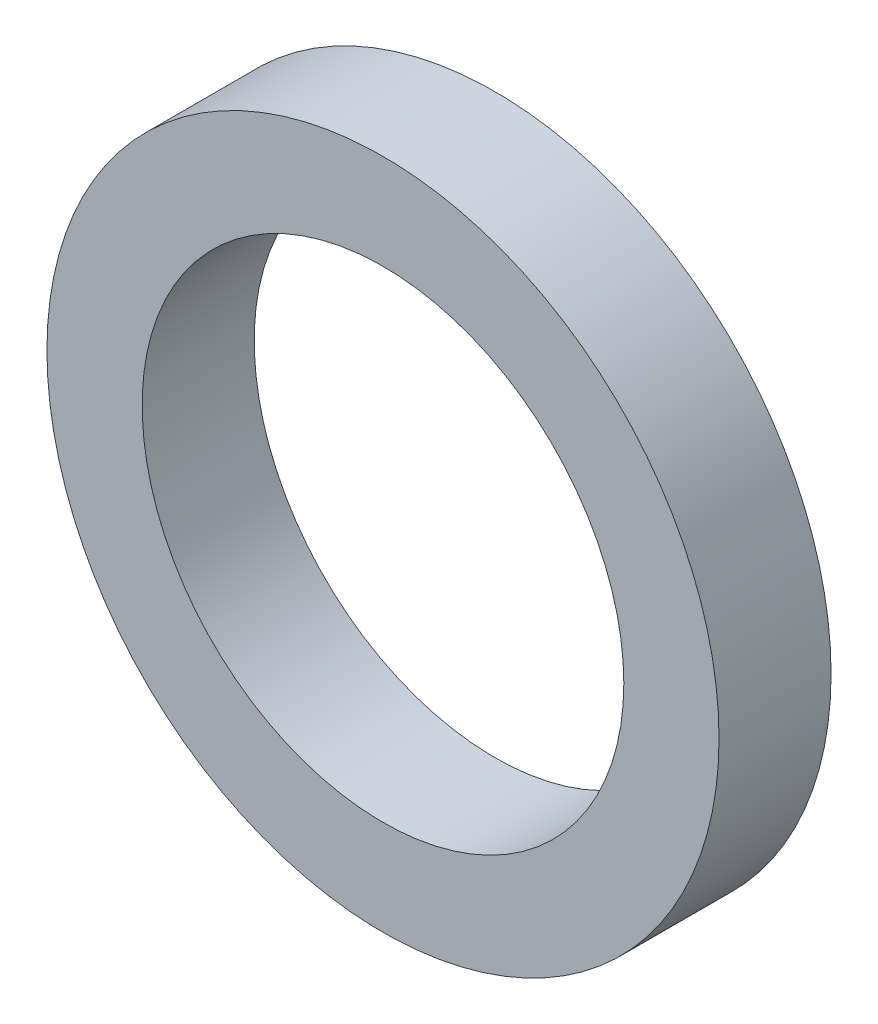
ISO-10303-21;
HEADER;
FILE_DESCRIPTION(('STEP AP214'),'2;1');
FILE_NAME('part.step','',(''),(''),'','','');
FILE_SCHEMA(('AUTOMOTIVE_DESIGN { 1 0 10303 214 1 1 1 1 }'));
ENDSEC;
DATA;
#1=APPLICATION_CONTEXT('core data for automotive mechanical design processes');
#2=APPLICATION_PROTOCOL_DEFINITION('international standard','automotive_design',2000,#1);
#3=PRODUCT_CONTEXT('',#1,'mechanical');
#4=PRODUCT('Part','Part','',(#3));
#5=PRODUCT_RELATED_PRODUCT_CATEGORY('part','',(#4));
#6=PRODUCT_DEFINITION_FORMATION('','',#4);
#7=PRODUCT_DEFINITION_CONTEXT('part definition',#1,'design');
#8=PRODUCT_DEFINITION('design','',#6,#7);
#9=PRODUCT_DEFINITION_SHAPE('','',#8);
#10=(LENGTH_UNIT() NAMED_UNIT(*) SI_UNIT(.MILLI.,.METRE.));
#11=(NAMED_UNIT(*) PLANE_ANGLE_UNIT() SI_UNIT($,.RADIAN.));
#12=(NAMED_UNIT(*) SI_UNIT($,.STERADIAN.) SOLID_ANGLE_UNIT());
#13=UNCERTAINTY_MEASURE_WITH_UNIT(LENGTH_MEASURE(1.E-05),#10,'distance_accuracy_value','');
#14=(GEOMETRIC_REPRESENTATION_CONTEXT(3) GLOBAL_UNCERTAINTY_ASSIGNED_CONTEXT((#13)) GLOBAL_UNIT_ASSIGNED_CONTEXT((#10,
#11,#12)) REPRESENTATION_CONTEXT('',''));
#15=CARTESIAN_POINT('',(0.,0.,0.));
#16=DIRECTION('',(0.,0.,1.));
#17=DIRECTION('',(1.,0.,0.));
#18=AXIS2_PLACEMENT_3D('',#15,#16,#17);
#19=CARTESIAN_POINT('',(0.,0.,1.));
#20=DIRECTION('',(0.,0.,1.));
#21=DIRECTION('',(1.,0.,0.));
#22=AXIS2_PLACEMENT_3D('',#19,#20,#21);
#23=PLANE('',#22);
#24=CARTESIAN_POINT('',(0.,0.,1.));
#25=DIRECTION('',(0.,0.,1.));
#26=DIRECTION('',(1.,0.,0.));
#27=AXIS2_PLACEMENT_3D('',#24,#25,#26);
#28=CIRCLE('',#27,3.);
#29=CARTESIAN_POINT('',(3.,0.,1.));
#30=VERTEX_POINT('',#29);
#31=EDGE_CURVE('E10',#30,#30,#28,.T.);
#32=ORIENTED_EDGE('',*,*,#31,.T.);
#33=EDGE_LOOP('',(#32));
#34=FACE_BOUND('',#33,.T.);
#35=CARTESIAN_POINT('',(0.,0.,1.));
#36=DIRECTION('',(0.,0.,1.));
#37=DIRECTION('',(1.,0.,0.));
#38=AXIS2_PLACEMENT_3D('',#35,#36,#37);
#39=CIRCLE('',#38,2.15);
#40=CARTESIAN_POINT('',(2.15,0.,1.));
#41=VERTEX_POINT('',#40);
#42=EDGE_CURVE('E56',#41,#41,#39,.T.);
#43=ORIENTED_EDGE('',*,*,#42,.F.);
#44=EDGE_LOOP('',(#43));
#45=FACE_BOUND('',#44,.T.);
#46=ADVANCED_FACE('F43',(#34,#45),#23,.T.);
#47=CARTESIAN_POINT('',(0.,0.,0.));
#48=DIRECTION('',(0.,0.,1.));
#49=DIRECTION('',(1.,0.,0.));
#50=AXIS2_PLACEMENT_3D('',#47,#48,#49);
#51=PLANE('',#50);
#52=CARTESIAN_POINT('',(0.,0.,0.));
#53=DIRECTION('',(0.,0.,1.));
#54=DIRECTION('',(1.,0.,0.));
#55=AXIS2_PLACEMENT_3D('',#52,#53,#54);
#56=CIRCLE('',#55,3.);
#57=CARTESIAN_POINT('',(3.,0.,0.));
#58=VERTEX_POINT('',#57);
#59=EDGE_CURVE('E47',#58,#58,#56,.T.);
#60=ORIENTED_EDGE('',*,*,#59,.F.);
#61=EDGE_LOOP('',(#60));
#62=FACE_BOUND('',#61,.T.);
#63=CARTESIAN_POINT('',(0.,0.,0.));
#64=DIRECTION('',(0.,0.,1.));
#65=DIRECTION('',(1.,0.,0.));
#66=AXIS2_PLACEMENT_3D('',#63,#64,#65);
#67=CIRCLE('',#66,2.15);
#68=CARTESIAN_POINT('',(2.15,0.,0.));
#69=VERTEX_POINT('',#68);
#70=EDGE_CURVE('E58',#69,#69,#67,.T.);
#71=ORIENTED_EDGE('',*,*,#70,.T.);
#72=EDGE_LOOP('',(#71));
#73=FACE_BOUND('',#72,.T.);
#74=ADVANCED_FACE('F70',(#62,#73),#51,.F.);
#75=CARTESIAN_POINT('',(0.,0.,1.));
#76=DIRECTION('',(0.,0.,-1.));
#77=DIRECTION('',(-1.,0.,0.));
#78=AXIS2_PLACEMENT_3D('',#75,#76,#77);
#79=CYLINDRICAL_SURFACE('',#78,3.);
#80=ORIENTED_EDGE('',*,*,#31,.F.);
#81=EDGE_LOOP('',(#80));
#82=FACE_BOUND('',#81,.T.);
#83=ORIENTED_EDGE('',*,*,#59,.T.);
#84=EDGE_LOOP('',(#83));
#85=FACE_BOUND('',#84,.T.);
#86=ADVANCED_FACE('F45',(#82,#85),#79,.T.);
#87=CARTESIAN_POINT('',(0.,0.,1.));
#88=DIRECTION('',(0.,0.,-1.));
#89=DIRECTION('',(-1.,0.,0.));
#90=AXIS2_PLACEMENT_3D('',#87,#88,#89);
#91=CYLINDRICAL_SURFACE('',#90,2.15);
#92=ORIENTED_EDGE('',*,*,#42,.T.);
#93=EDGE_LOOP('',(#92));
#94=FACE_BOUND('',#93,.T.);
#95=ORIENTED_EDGE('',*,*,#70,.F.);
#96=EDGE_LOOP('',(#95));
#97=FACE_BOUND('',#96,.T.);
#98=ADVANCED_FACE('F66',(#94,#97),#91,.F.);
#99=CLOSED_SHELL('',(#46,#74,#86,#98));
#100=MANIFOLD_SOLID_BREP('B2',#99);
#101=ADVANCED_BREP_SHAPE_REPRESENTATION('',(#18,#100),#14);
#102=SHAPE_DEFINITION_REPRESENTATION(#9,#101);
ENDSEC;
END-ISO-10303-21;
